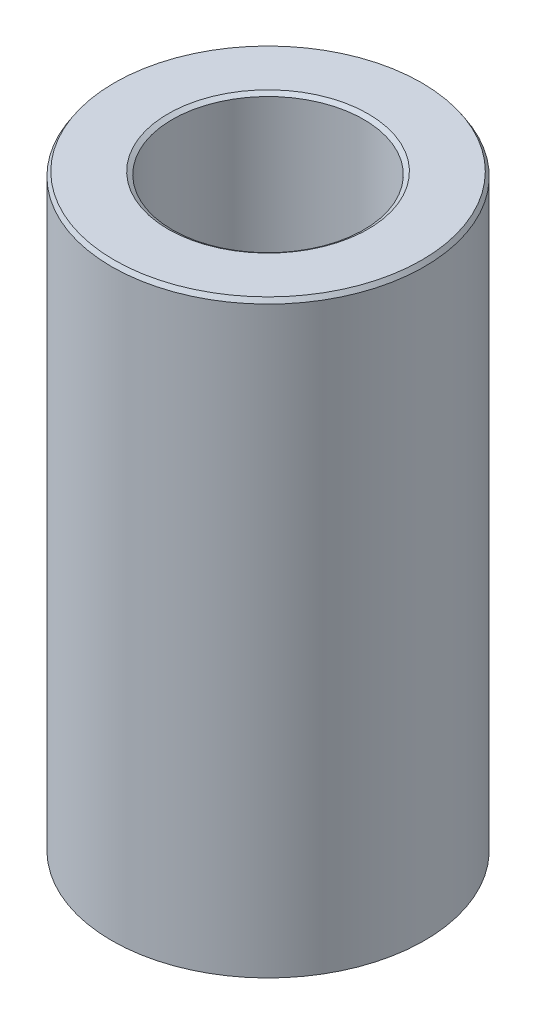
ISO-10303-21;
HEADER;
FILE_DESCRIPTION(('STEP AP214'),'2;1');
FILE_NAME('part.step','',(''),(''),'','','');
FILE_SCHEMA(('AUTOMOTIVE_DESIGN { 1 0 10303 214 1 1 1 1 }'));
ENDSEC;
DATA;
#1=APPLICATION_CONTEXT('core data for automotive mechanical design processes');
#2=APPLICATION_PROTOCOL_DEFINITION('international standard','automotive_design',2000,#1);
#3=PRODUCT_CONTEXT('',#1,'mechanical');
#4=PRODUCT('Part','Part','',(#3));
#5=PRODUCT_RELATED_PRODUCT_CATEGORY('part','',(#4));
#6=PRODUCT_DEFINITION_FORMATION('','',#4);
#7=PRODUCT_DEFINITION_CONTEXT('part definition',#1,'design');
#8=PRODUCT_DEFINITION('design','',#6,#7);
#9=PRODUCT_DEFINITION_SHAPE('','',#8);
#10=(LENGTH_UNIT() NAMED_UNIT(*) SI_UNIT(.MILLI.,.METRE.));
#11=(NAMED_UNIT(*) PLANE_ANGLE_UNIT() SI_UNIT($,.RADIAN.));
#12=(NAMED_UNIT(*) SI_UNIT($,.STERADIAN.) SOLID_ANGLE_UNIT());
#13=UNCERTAINTY_MEASURE_WITH_UNIT(LENGTH_MEASURE(1.E-05),#10,'distance_accuracy_value','');
#14=(GEOMETRIC_REPRESENTATION_CONTEXT(3) GLOBAL_UNCERTAINTY_ASSIGNED_CONTEXT((#13)) GLOBAL_UNIT_ASSIGNED_CONTEXT((#10,
#11,#12)) REPRESENTATION_CONTEXT('',''));
#15=CARTESIAN_POINT('',(0.,0.,0.));
#16=DIRECTION('',(0.,0.,1.));
#17=DIRECTION('',(1.,0.,0.));
#18=AXIS2_PLACEMENT_3D('',#15,#16,#17);
#19=CARTESIAN_POINT('',(0.,141.62791683123,0.));
#20=DIRECTION('',(0.,-1.,0.));
#21=DIRECTION('',(0.,0.,-1.));
#22=AXIS2_PLACEMENT_3D('',#19,#20,#21);
#23=CYLINDRICAL_SURFACE('',#22,37.5);
#24=CARTESIAN_POINT('',(0.,0.659392673231146,0.));
#25=DIRECTION('',(0.,1.,0.));
#26=DIRECTION('',(0.,0.,1.));
#27=AXIS2_PLACEMENT_3D('',#24,#25,#26);
#28=CIRCLE('',#27,37.5);
#29=CARTESIAN_POINT('',(0.,0.659392673231146,37.5));
#30=VERTEX_POINT('',#29);
#31=EDGE_CURVE('E10',#30,#30,#28,.T.);
#32=ORIENTED_EDGE('',*,*,#31,.T.);
#33=EDGE_LOOP('',(#32));
#34=FACE_BOUND('',#33,.T.);
#35=CARTESIAN_POINT('',(0.,140.595605123786,0.));
#36=DIRECTION('',(0.,1.,0.));
#37=DIRECTION('',(0.,0.,1.));
#38=AXIS2_PLACEMENT_3D('',#35,#36,#37);
#39=CIRCLE('',#38,37.5);
#40=CARTESIAN_POINT('',(0.,140.595605123786,37.5));
#41=VERTEX_POINT('',#40);
#42=EDGE_CURVE('E50',#41,#41,#39,.F.);
#43=ORIENTED_EDGE('',*,*,#42,.T.);
#44=EDGE_LOOP('',(#43));
#45=FACE_BOUND('',#44,.T.);
#46=ADVANCED_FACE('F39',(#34,#45),#23,.T.);
#47=CARTESIAN_POINT('',(0.,141.62791683123,0.));
#48=DIRECTION('',(0.,1.,0.));
#49=DIRECTION('',(0.,0.,1.));
#50=AXIS2_PLACEMENT_3D('',#47,#48,#49);
#51=PLANE('',#50);
#52=CARTESIAN_POINT('',(0.,141.62791683123,0.));
#53=DIRECTION('',(0.,1.,0.));
#54=DIRECTION('',(0.,0.,1.));
#55=AXIS2_PLACEMENT_3D('',#52,#53,#54);
#56=CIRCLE('',#55,23.975697568946);
#57=CARTESIAN_POINT('',(0.,141.62791683123,23.975697568946));
#58=VERTEX_POINT('',#57);
#59=EDGE_CURVE('E58',#58,#58,#56,.F.);
#60=ORIENTED_EDGE('',*,*,#59,.T.);
#61=EDGE_LOOP('',(#60));
#62=FACE_BOUND('',#61,.T.);
#63=CARTESIAN_POINT('',(0.,141.62791683123,0.));
#64=DIRECTION('',(0.,1.,0.));
#65=DIRECTION('',(0.,0.,1.));
#66=AXIS2_PLACEMENT_3D('',#63,#64,#65);
#67=CIRCLE('',#66,36.8406073267689);
#68=CARTESIAN_POINT('',(0.,141.62791683123,36.8406073267689));
#69=VERTEX_POINT('',#68);
#70=EDGE_CURVE('E61',#69,#69,#67,.T.);
#71=ORIENTED_EDGE('',*,*,#70,.T.);
#72=EDGE_LOOP('',(#71));
#73=FACE_BOUND('',#72,.T.);
#74=ADVANCED_FACE('F88',(#62,#73),#51,.T.);
#75=CARTESIAN_POINT('',(0.,0.,0.));
#76=DIRECTION('',(0.,1.,0.));
#77=DIRECTION('',(0.,0.,1.));
#78=AXIS2_PLACEMENT_3D('',#75,#76,#77);
#79=PLANE('',#78);
#80=CARTESIAN_POINT('',(0.,0.,0.));
#81=DIRECTION('',(0.,1.,0.));
#82=DIRECTION('',(0.,0.,1.));
#83=AXIS2_PLACEMENT_3D('',#80,#81,#82);
#84=CIRCLE('',#83,23.6027785347329);
#85=CARTESIAN_POINT('',(0.,0.,23.6027785347329));
#86=VERTEX_POINT('',#85);
#87=EDGE_CURVE('E51',#86,#86,#84,.T.);
#88=ORIENTED_EDGE('',*,*,#87,.T.);
#89=EDGE_LOOP('',(#88));
#90=FACE_BOUND('',#89,.T.);
#91=CARTESIAN_POINT('',(0.,0.,0.));
#92=DIRECTION('',(0.,1.,0.));
#93=DIRECTION('',(0.,0.,1.));
#94=AXIS2_PLACEMENT_3D('',#91,#92,#93);
#95=CIRCLE('',#94,36.4676882925558);
#96=CARTESIAN_POINT('',(0.,0.,36.4676882925558));
#97=VERTEX_POINT('',#96);
#98=EDGE_CURVE('E54',#97,#97,#95,.F.);
#99=ORIENTED_EDGE('',*,*,#98,.T.);
#100=EDGE_LOOP('',(#99));
#101=FACE_BOUND('',#100,.T.);
#102=ADVANCED_FACE('F83',(#90,#101),#79,.F.);
#103=CARTESIAN_POINT('',(0.,141.62791683123,0.));
#104=DIRECTION('',(0.,-1.,0.));
#105=DIRECTION('',(0.,0.,-1.));
#106=AXIS2_PLACEMENT_3D('',#103,#104,#105);
#107=CYLINDRICAL_SURFACE('',#106,22.9433858615018);
#108=CARTESIAN_POINT('',(0.,140.968524157999,0.));
#109=DIRECTION('',(0.,1.,0.));
#110=DIRECTION('',(0.,0.,1.));
#111=AXIS2_PLACEMENT_3D('',#108,#109,#110);
#112=CIRCLE('',#111,22.9433858615018);
#113=CARTESIAN_POINT('',(0.,140.968524157999,22.9433858615018));
#114=VERTEX_POINT('',#113);
#115=EDGE_CURVE('E67',#114,#114,#112,.T.);
#116=ORIENTED_EDGE('',*,*,#115,.T.);
#117=EDGE_LOOP('',(#116));
#118=FACE_BOUND('',#117,.T.);
#119=CARTESIAN_POINT('',(0.,1.03231170744419,0.));
#120=DIRECTION('',(0.,1.,0.));
#121=DIRECTION('',(0.,0.,1.));
#122=AXIS2_PLACEMENT_3D('',#119,#120,#121);
#123=CIRCLE('',#122,22.9433858615018);
#124=CARTESIAN_POINT('',(0.,1.03231170744419,22.9433858615018));
#125=VERTEX_POINT('',#124);
#126=EDGE_CURVE('E69',#125,#125,#123,.F.);
#127=ORIENTED_EDGE('',*,*,#126,.T.);
#128=EDGE_LOOP('',(#127));
#129=FACE_BOUND('',#128,.T.);
#130=ADVANCED_FACE('F71',(#118,#129),#107,.F.);
#131=CARTESIAN_POINT('',(0.,140.968524157999,0.));
#132=DIRECTION('',(0.,1.,0.));
#133=DIRECTION('',(0.,0.,1.));
#134=AXIS2_PLACEMENT_3D('',#131,#132,#133);
#135=CONICAL_SURFACE('',#134,22.9433858615018,1.00236795920397);
#136=ORIENTED_EDGE('',*,*,#59,.F.);
#137=EDGE_LOOP('',(#136));
#138=FACE_BOUND('',#137,.T.);
#139=ORIENTED_EDGE('',*,*,#115,.F.);
#140=EDGE_LOOP('',(#139));
#141=FACE_BOUND('',#140,.T.);
#142=ADVANCED_FACE('F77',(#138,#141),#135,.F.);
#143=CARTESIAN_POINT('',(0.,0.,0.));
#144=DIRECTION('',(0.,-1.,0.));
#145=DIRECTION('',(0.,0.,-1.));
#146=AXIS2_PLACEMENT_3D('',#143,#144,#145);
#147=CONICAL_SURFACE('',#146,23.6027785347329,0.568428367590923);
#148=ORIENTED_EDGE('',*,*,#126,.F.);
#149=EDGE_LOOP('',(#148));
#150=FACE_BOUND('',#149,.T.);
#151=ORIENTED_EDGE('',*,*,#87,.F.);
#152=EDGE_LOOP('',(#151));
#153=FACE_BOUND('',#152,.T.);
#154=ADVANCED_FACE('F73',(#150,#153),#147,.F.);
#155=CARTESIAN_POINT('',(0.,0.659392673231146,0.));
#156=DIRECTION('',(0.,1.,0.));
#157=DIRECTION('',(0.,0.,1.));
#158=AXIS2_PLACEMENT_3D('',#155,#156,#157);
#159=CONICAL_SURFACE('',#158,37.5,1.00236795920395);
#160=ORIENTED_EDGE('',*,*,#98,.F.);
#161=EDGE_LOOP('',(#160));
#162=FACE_BOUND('',#161,.T.);
#163=ORIENTED_EDGE('',*,*,#31,.F.);
#164=EDGE_LOOP('',(#163));
#165=FACE_BOUND('',#164,.T.);
#166=ADVANCED_FACE('F76',(#162,#165),#159,.T.);
#167=CARTESIAN_POINT('',(0.,141.62791683123,0.));
#168=DIRECTION('',(0.,-1.,0.));
#169=DIRECTION('',(0.,0.,-1.));
#170=AXIS2_PLACEMENT_3D('',#167,#168,#169);
#171=CONICAL_SURFACE('',#170,36.8406073267689,0.56842836759093);
#172=ORIENTED_EDGE('',*,*,#42,.F.);
#173=EDGE_LOOP('',(#172));
#174=FACE_BOUND('',#173,.T.);
#175=ORIENTED_EDGE('',*,*,#70,.F.);
#176=EDGE_LOOP('',(#175));
#177=FACE_BOUND('',#176,.T.);
#178=ADVANCED_FACE('F45',(#174,#177),#171,.T.);
#179=CLOSED_SHELL('',(#46,#74,#102,#130,#142,#154,#166,#178));
#180=MANIFOLD_SOLID_BREP('B2',#179);
#181=ADVANCED_BREP_SHAPE_REPRESENTATION('',(#18,#180),#14);
#182=SHAPE_DEFINITION_REPRESENTATION(#9,#181);
ENDSEC;
END-ISO-10303-21;
